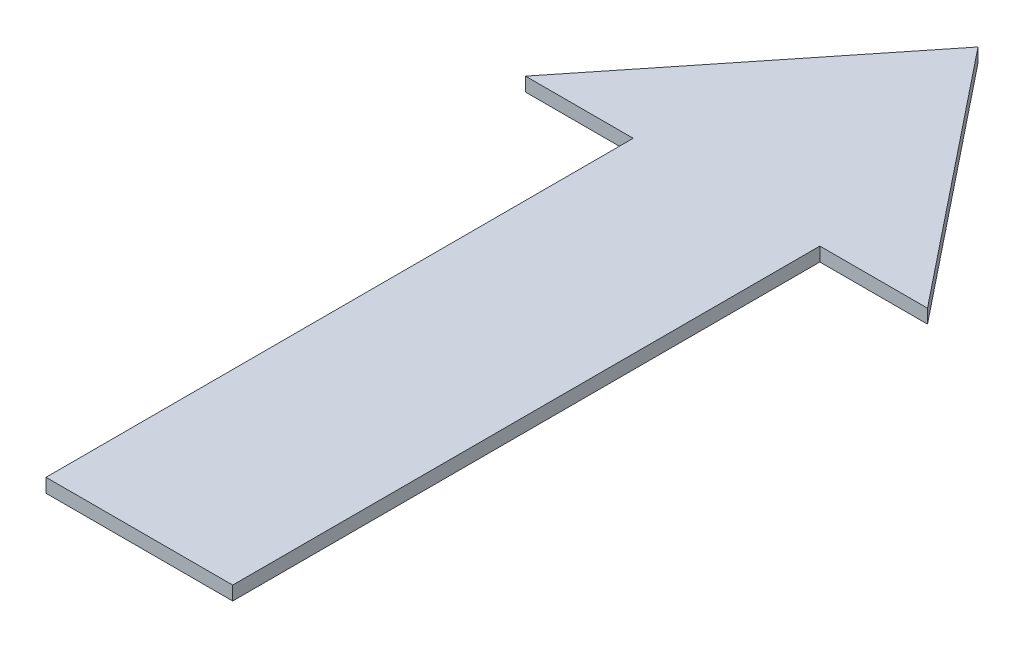
ISO-10303-21;
HEADER;
FILE_DESCRIPTION(('STEP AP214'),'2;1');
FILE_NAME('part.step','',(''),(''),'','','');
FILE_SCHEMA(('AUTOMOTIVE_DESIGN { 1 0 10303 214 1 1 1 1 }'));
ENDSEC;
DATA;
#1=APPLICATION_CONTEXT('core data for automotive mechanical design processes');
#2=APPLICATION_PROTOCOL_DEFINITION('international standard','automotive_design',2000,#1);
#3=PRODUCT_CONTEXT('',#1,'mechanical');
#4=PRODUCT('Part','Part','',(#3));
#5=PRODUCT_RELATED_PRODUCT_CATEGORY('part','',(#4));
#6=PRODUCT_DEFINITION_FORMATION('','',#4);
#7=PRODUCT_DEFINITION_CONTEXT('part definition',#1,'design');
#8=PRODUCT_DEFINITION('design','',#6,#7);
#9=PRODUCT_DEFINITION_SHAPE('','',#8);
#10=(LENGTH_UNIT() NAMED_UNIT(*) SI_UNIT(.MILLI.,.METRE.));
#11=(NAMED_UNIT(*) PLANE_ANGLE_UNIT() SI_UNIT($,.RADIAN.));
#12=(NAMED_UNIT(*) SI_UNIT($,.STERADIAN.) SOLID_ANGLE_UNIT());
#13=UNCERTAINTY_MEASURE_WITH_UNIT(LENGTH_MEASURE(1.E-05),#10,'distance_accuracy_value','');
#14=(GEOMETRIC_REPRESENTATION_CONTEXT(3) GLOBAL_UNCERTAINTY_ASSIGNED_CONTEXT((#13)) GLOBAL_UNIT_ASSIGNED_CONTEXT((#10,
#11,#12)) REPRESENTATION_CONTEXT('',''));
#15=CARTESIAN_POINT('',(0.,0.,0.));
#16=DIRECTION('',(0.,0.,1.));
#17=DIRECTION('',(1.,0.,0.));
#18=AXIS2_PLACEMENT_3D('',#15,#16,#17);
#19=CARTESIAN_POINT('',(13.4951138080928,1.,0.));
#20=DIRECTION('',(0.,0.,-1.));
#21=DIRECTION('',(-1.,0.,0.));
#22=AXIS2_PLACEMENT_3D('',#19,#20,#21);
#23=PLANE('',#22);
#24=DIRECTION('',(1.,0.,0.));
#25=VECTOR('',#24,1.);
#26=CARTESIAN_POINT('',(13.4951138080928,0.,0.));
#27=LINE('',#26,#25);
#28=CARTESIAN_POINT('',(0.,0.,0.));
#29=VERTEX_POINT('',#28);
#30=CARTESIAN_POINT('',(13.4951138080928,0.,0.));
#31=VERTEX_POINT('',#30);
#32=EDGE_CURVE('E127',#29,#31,#27,.T.);
#33=ORIENTED_EDGE('',*,*,#32,.T.);
#34=DIRECTION('',(0.,-1.,0.));
#35=VECTOR('',#34,1.);
#36=CARTESIAN_POINT('',(13.4951138080928,1.,0.));
#37=LINE('',#36,#35);
#38=CARTESIAN_POINT('',(13.4951138080928,1.,0.));
#39=VERTEX_POINT('',#38);
#40=EDGE_CURVE('E11',#39,#31,#37,.T.);
#41=ORIENTED_EDGE('',*,*,#40,.F.);
#42=DIRECTION('',(1.,0.,0.));
#43=VECTOR('',#42,1.);
#44=CARTESIAN_POINT('',(13.4951138080928,1.,0.));
#45=LINE('',#44,#43);
#46=CARTESIAN_POINT('',(0.,1.,0.));
#47=VERTEX_POINT('',#46);
#48=EDGE_CURVE('E139',#47,#39,#45,.T.);
#49=ORIENTED_EDGE('',*,*,#48,.F.);
#50=DIRECTION('',(0.,-1.,0.));
#51=VECTOR('',#50,1.);
#52=CARTESIAN_POINT('',(0.,1.,0.));
#53=LINE('',#52,#51);
#54=EDGE_CURVE('E123',#47,#29,#53,.T.);
#55=ORIENTED_EDGE('',*,*,#54,.T.);
#56=EDGE_LOOP('',(#33,#41,#49,#55));
#57=FACE_BOUND('',#56,.T.);
#58=ADVANCED_FACE('F37',(#57),#23,.F.);
#59=CARTESIAN_POINT('',(13.4951138080928,1.,-42.446359223301));
#60=DIRECTION('',(-1.,0.,0.));
#61=DIRECTION('',(0.,0.,1.));
#62=AXIS2_PLACEMENT_3D('',#59,#60,#61);
#63=PLANE('',#62);
#64=DIRECTION('',(0.,0.,-1.));
#65=VECTOR('',#64,1.);
#66=CARTESIAN_POINT('',(13.4951138080928,0.,-42.446359223301));
#67=LINE('',#66,#65);
#68=CARTESIAN_POINT('',(13.4951138080928,0.,-42.446359223301));
#69=VERTEX_POINT('',#68);
#70=EDGE_CURVE('E130',#31,#69,#67,.T.);
#71=ORIENTED_EDGE('',*,*,#70,.T.);
#72=DIRECTION('',(0.,-1.,0.));
#73=VECTOR('',#72,1.);
#74=CARTESIAN_POINT('',(13.4951138080928,1.,-42.446359223301));
#75=LINE('',#74,#73);
#76=CARTESIAN_POINT('',(13.4951138080928,1.,-42.446359223301));
#77=VERTEX_POINT('',#76);
#78=EDGE_CURVE('E45',#77,#69,#75,.T.);
#79=ORIENTED_EDGE('',*,*,#78,.F.);
#80=DIRECTION('',(0.,0.,-1.));
#81=VECTOR('',#80,1.);
#82=CARTESIAN_POINT('',(13.4951138080928,1.,-42.446359223301));
#83=LINE('',#82,#81);
#84=EDGE_CURVE('E93',#39,#77,#83,.T.);
#85=ORIENTED_EDGE('',*,*,#84,.F.);
#86=ORIENTED_EDGE('',*,*,#40,.T.);
#87=EDGE_LOOP('',(#71,#79,#85,#86));
#88=FACE_BOUND('',#87,.T.);
#89=ADVANCED_FACE('F164',(#88),#63,.F.);
#90=CARTESIAN_POINT('',(21.2761704350252,1.,-42.446359223301));
#91=DIRECTION('',(0.,0.,-1.));
#92=DIRECTION('',(-1.,0.,0.));
#93=AXIS2_PLACEMENT_3D('',#90,#91,#92);
#94=PLANE('',#93);
#95=DIRECTION('',(1.,0.,0.));
#96=VECTOR('',#95,1.);
#97=CARTESIAN_POINT('',(21.2761704350252,0.,-42.446359223301));
#98=LINE('',#97,#96);
#99=CARTESIAN_POINT('',(21.2761704350252,0.,-42.446359223301));
#100=VERTEX_POINT('',#99);
#101=EDGE_CURVE('E132',#69,#100,#98,.T.);
#102=ORIENTED_EDGE('',*,*,#101,.T.);
#103=DIRECTION('',(0.,-1.,0.));
#104=VECTOR('',#103,1.);
#105=CARTESIAN_POINT('',(21.2761704350252,1.,-42.446359223301));
#106=LINE('',#105,#104);
#107=CARTESIAN_POINT('',(21.2761704350252,1.,-42.446359223301));
#108=VERTEX_POINT('',#107);
#109=EDGE_CURVE('E143',#108,#100,#106,.T.);
#110=ORIENTED_EDGE('',*,*,#109,.F.);
#111=DIRECTION('',(1.,0.,0.));
#112=VECTOR('',#111,1.);
#113=CARTESIAN_POINT('',(21.2761704350252,1.,-42.446359223301));
#114=LINE('',#113,#112);
#115=EDGE_CURVE('E151',#77,#108,#114,.T.);
#116=ORIENTED_EDGE('',*,*,#115,.F.);
#117=ORIENTED_EDGE('',*,*,#78,.T.);
#118=EDGE_LOOP('',(#102,#110,#116,#117));
#119=FACE_BOUND('',#118,.T.);
#120=ADVANCED_FACE('F149',(#119),#94,.F.);
#121=CARTESIAN_POINT('',(6.7475569040464,1.,-60.625748935266));
#122=DIRECTION('',(-0.781180998534282,0.,0.624304611170687));
#123=DIRECTION('',(0.624304611170687,0.,0.781180998534282));
#124=AXIS2_PLACEMENT_3D('',#121,#122,#123);
#125=PLANE('',#124);
#126=DIRECTION('',(-0.624304611170687,0.,-0.781180998534282));
#127=VECTOR('',#126,1.);
#128=CARTESIAN_POINT('',(6.7475569040464,0.,-60.625748935266));
#129=LINE('',#128,#127);
#130=CARTESIAN_POINT('',(6.7475569040464,0.,-60.625748935266));
#131=VERTEX_POINT('',#130);
#132=EDGE_CURVE('E134',#100,#131,#129,.T.);
#133=ORIENTED_EDGE('',*,*,#132,.T.);
#134=DIRECTION('',(0.,-1.,0.));
#135=VECTOR('',#134,1.);
#136=CARTESIAN_POINT('',(6.7475569040464,1.,-60.625748935266));
#137=LINE('',#136,#135);
#138=CARTESIAN_POINT('',(6.7475569040464,1.,-60.625748935266));
#139=VERTEX_POINT('',#138);
#140=EDGE_CURVE('E118',#139,#131,#137,.T.);
#141=ORIENTED_EDGE('',*,*,#140,.F.);
#142=DIRECTION('',(-0.624304611170687,0.,-0.781180998534282));
#143=VECTOR('',#142,1.);
#144=CARTESIAN_POINT('',(6.7475569040464,1.,-60.625748935266));
#145=LINE('',#144,#143);
#146=EDGE_CURVE('E109',#108,#139,#145,.T.);
#147=ORIENTED_EDGE('',*,*,#146,.F.);
#148=ORIENTED_EDGE('',*,*,#109,.T.);
#149=EDGE_LOOP('',(#133,#141,#147,#148));
#150=FACE_BOUND('',#149,.T.);
#151=ADVANCED_FACE('F157',(#150),#125,.F.);
#152=CARTESIAN_POINT('',(-7.78105662693241,1.,-42.446359223301));
#153=DIRECTION('',(0.781180998534282,0.,0.624304611170687));
#154=DIRECTION('',(0.624304611170687,0.,-0.781180998534282));
#155=AXIS2_PLACEMENT_3D('',#152,#153,#154);
#156=PLANE('',#155);
#157=DIRECTION('',(-0.624304611170687,0.,0.781180998534282));
#158=VECTOR('',#157,1.);
#159=CARTESIAN_POINT('',(-7.78105662693241,0.,-42.446359223301));
#160=LINE('',#159,#158);
#161=CARTESIAN_POINT('',(-7.78105662693241,0.,-42.446359223301));
#162=VERTEX_POINT('',#161);
#163=EDGE_CURVE('E117',#131,#162,#160,.T.);
#164=ORIENTED_EDGE('',*,*,#163,.T.);
#165=DIRECTION('',(0.,-1.,0.));
#166=VECTOR('',#165,1.);
#167=CARTESIAN_POINT('',(-7.78105662693241,1.,-42.446359223301));
#168=LINE('',#167,#166);
#169=CARTESIAN_POINT('',(-7.78105662693241,1.,-42.446359223301));
#170=VERTEX_POINT('',#169);
#171=EDGE_CURVE('E114',#170,#162,#168,.T.);
#172=ORIENTED_EDGE('',*,*,#171,.F.);
#173=DIRECTION('',(-0.624304611170687,0.,0.781180998534282));
#174=VECTOR('',#173,1.);
#175=CARTESIAN_POINT('',(-7.78105662693241,1.,-42.446359223301));
#176=LINE('',#175,#174);
#177=EDGE_CURVE('E103',#139,#170,#176,.T.);
#178=ORIENTED_EDGE('',*,*,#177,.F.);
#179=ORIENTED_EDGE('',*,*,#140,.T.);
#180=EDGE_LOOP('',(#164,#172,#178,#179));
#181=FACE_BOUND('',#180,.T.);
#182=ADVANCED_FACE('F115',(#181),#156,.F.);
#183=CARTESIAN_POINT('',(0.,1.,-42.446359223301));
#184=DIRECTION('',(0.,0.,-1.));
#185=DIRECTION('',(-1.,0.,0.));
#186=AXIS2_PLACEMENT_3D('',#183,#184,#185);
#187=PLANE('',#186);
#188=DIRECTION('',(1.,0.,0.));
#189=VECTOR('',#188,1.);
#190=CARTESIAN_POINT('',(0.,0.,-42.446359223301));
#191=LINE('',#190,#189);
#192=CARTESIAN_POINT('',(0.,0.,-42.446359223301));
#193=VERTEX_POINT('',#192);
#194=EDGE_CURVE('E79',#162,#193,#191,.T.);
#195=ORIENTED_EDGE('',*,*,#194,.T.);
#196=DIRECTION('',(0.,-1.,0.));
#197=VECTOR('',#196,1.);
#198=CARTESIAN_POINT('',(0.,1.,-42.446359223301));
#199=LINE('',#198,#197);
#200=CARTESIAN_POINT('',(0.,1.,-42.446359223301));
#201=VERTEX_POINT('',#200);
#202=EDGE_CURVE('E119',#201,#193,#199,.T.);
#203=ORIENTED_EDGE('',*,*,#202,.F.);
#204=DIRECTION('',(1.,0.,0.));
#205=VECTOR('',#204,1.);
#206=CARTESIAN_POINT('',(0.,1.,-42.446359223301));
#207=LINE('',#206,#205);
#208=EDGE_CURVE('E107',#170,#201,#207,.T.);
#209=ORIENTED_EDGE('',*,*,#208,.F.);
#210=ORIENTED_EDGE('',*,*,#171,.T.);
#211=EDGE_LOOP('',(#195,#203,#209,#210));
#212=FACE_BOUND('',#211,.T.);
#213=ADVANCED_FACE('F121',(#212),#187,.F.);
#214=CARTESIAN_POINT('',(0.,1.,0.));
#215=DIRECTION('',(1.,0.,0.));
#216=DIRECTION('',(0.,0.,-1.));
#217=AXIS2_PLACEMENT_3D('',#214,#215,#216);
#218=PLANE('',#217);
#219=DIRECTION('',(0.,0.,1.));
#220=VECTOR('',#219,1.);
#221=CARTESIAN_POINT('',(0.,0.,0.));
#222=LINE('',#221,#220);
#223=EDGE_CURVE('E85',#193,#29,#222,.T.);
#224=ORIENTED_EDGE('',*,*,#223,.T.);
#225=ORIENTED_EDGE('',*,*,#54,.F.);
#226=DIRECTION('',(0.,0.,1.));
#227=VECTOR('',#226,1.);
#228=CARTESIAN_POINT('',(0.,1.,0.));
#229=LINE('',#228,#227);
#230=EDGE_CURVE('E53',#201,#47,#229,.T.);
#231=ORIENTED_EDGE('',*,*,#230,.F.);
#232=ORIENTED_EDGE('',*,*,#202,.T.);
#233=EDGE_LOOP('',(#224,#225,#231,#232));
#234=FACE_BOUND('',#233,.T.);
#235=ADVANCED_FACE('F178',(#234),#218,.F.);
#236=CARTESIAN_POINT('',(0.,1.,0.));
#237=DIRECTION('',(0.,-1.,0.));
#238=DIRECTION('',(0.,0.,-1.));
#239=AXIS2_PLACEMENT_3D('',#236,#237,#238);
#240=PLANE('',#239);
#241=ORIENTED_EDGE('',*,*,#48,.T.);
#242=ORIENTED_EDGE('',*,*,#84,.T.);
#243=ORIENTED_EDGE('',*,*,#115,.T.);
#244=ORIENTED_EDGE('',*,*,#146,.T.);
#245=ORIENTED_EDGE('',*,*,#177,.T.);
#246=ORIENTED_EDGE('',*,*,#208,.T.);
#247=ORIENTED_EDGE('',*,*,#230,.T.);
#248=EDGE_LOOP('',(#241,#242,#243,#244,#245,#246,#247));
#249=FACE_BOUND('',#248,.T.);
#250=ADVANCED_FACE('F105',(#249),#240,.F.);
#251=CARTESIAN_POINT('',(0.,0.,0.));
#252=DIRECTION('',(0.,-1.,0.));
#253=DIRECTION('',(0.,0.,-1.));
#254=AXIS2_PLACEMENT_3D('',#251,#252,#253);
#255=PLANE('',#254);
#256=ORIENTED_EDGE('',*,*,#32,.F.);
#257=ORIENTED_EDGE('',*,*,#223,.F.);
#258=ORIENTED_EDGE('',*,*,#194,.F.);
#259=ORIENTED_EDGE('',*,*,#163,.F.);
#260=ORIENTED_EDGE('',*,*,#132,.F.);
#261=ORIENTED_EDGE('',*,*,#101,.F.);
#262=ORIENTED_EDGE('',*,*,#70,.F.);
#263=EDGE_LOOP('',(#256,#257,#258,#259,#260,#261,#262));
#264=FACE_BOUND('',#263,.T.);
#265=ADVANCED_FACE('F155',(#264),#255,.T.);
#266=CLOSED_SHELL('',(#58,#89,#120,#151,#182,#213,#235,#250,#265));
#267=MANIFOLD_SOLID_BREP('B2',#266);
#268=ADVANCED_BREP_SHAPE_REPRESENTATION('',(#18,#267),#14);
#269=SHAPE_DEFINITION_REPRESENTATION(#9,#268);
ENDSEC;
END-ISO-10303-21;
